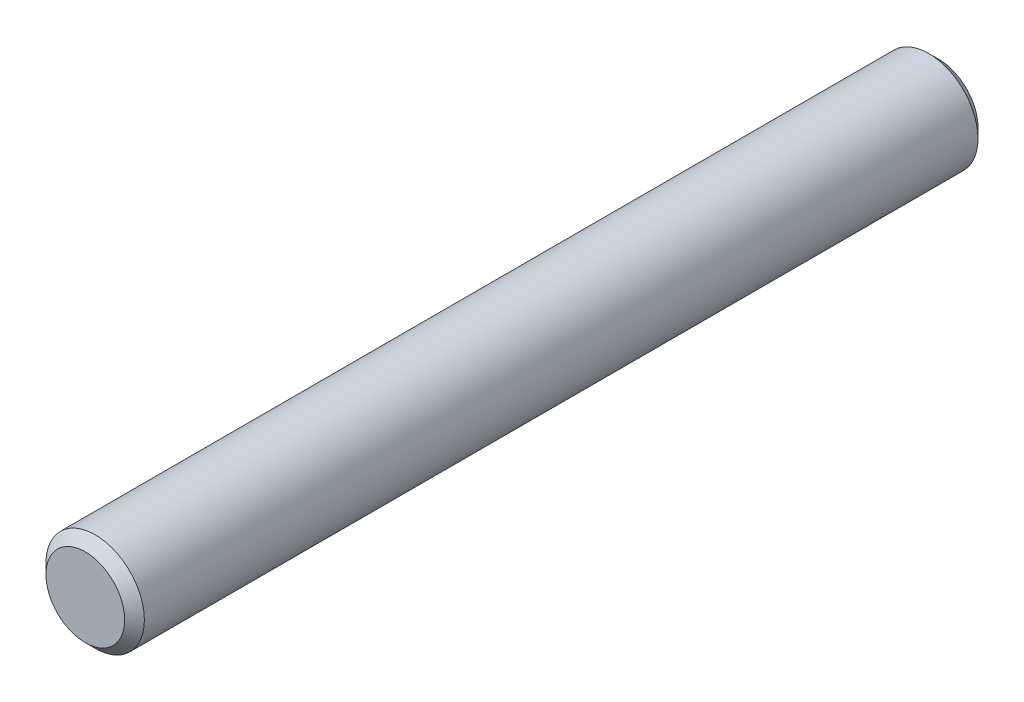
ISO-10303-21;
HEADER;
FILE_DESCRIPTION(('STEP AP214'),'2;1');
FILE_NAME('part.step','',(''),(''),'','','');
FILE_SCHEMA(('AUTOMOTIVE_DESIGN { 1 0 10303 214 1 1 1 1 }'));
ENDSEC;
DATA;
#1=APPLICATION_CONTEXT('core data for automotive mechanical design processes');
#2=APPLICATION_PROTOCOL_DEFINITION('international standard','automotive_design',2000,#1);
#3=PRODUCT_CONTEXT('',#1,'mechanical');
#4=PRODUCT('Part','Part','',(#3));
#5=PRODUCT_RELATED_PRODUCT_CATEGORY('part','',(#4));
#6=PRODUCT_DEFINITION_FORMATION('','',#4);
#7=PRODUCT_DEFINITION_CONTEXT('part definition',#1,'design');
#8=PRODUCT_DEFINITION('design','',#6,#7);
#9=PRODUCT_DEFINITION_SHAPE('','',#8);
#10=(LENGTH_UNIT() NAMED_UNIT(*) SI_UNIT(.MILLI.,.METRE.));
#11=(NAMED_UNIT(*) PLANE_ANGLE_UNIT() SI_UNIT($,.RADIAN.));
#12=(NAMED_UNIT(*) SI_UNIT($,.STERADIAN.) SOLID_ANGLE_UNIT());
#13=UNCERTAINTY_MEASURE_WITH_UNIT(LENGTH_MEASURE(1.E-05),#10,'distance_accuracy_value','');
#14=(GEOMETRIC_REPRESENTATION_CONTEXT(3) GLOBAL_UNCERTAINTY_ASSIGNED_CONTEXT((#13)) GLOBAL_UNIT_ASSIGNED_CONTEXT((#10,
#11,#12)) REPRESENTATION_CONTEXT('',''));
#15=CARTESIAN_POINT('',(0.,0.,0.));
#16=DIRECTION('',(0.,0.,1.));
#17=DIRECTION('',(1.,0.,0.));
#18=AXIS2_PLACEMENT_3D('',#15,#16,#17);
#19=CARTESIAN_POINT('',(0.,0.,13.));
#20=DIRECTION('',(0.,0.,-1.));
#21=DIRECTION('',(-1.,0.,0.));
#22=AXIS2_PLACEMENT_3D('',#19,#20,#21);
#23=CYLINDRICAL_SURFACE('',#22,1.5);
#24=CARTESIAN_POINT('',(0.,0.,-12.7));
#25=DIRECTION('',(0.,0.,1.));
#26=DIRECTION('',(1.,0.,0.));
#27=AXIS2_PLACEMENT_3D('',#24,#25,#26);
#28=CIRCLE('',#27,1.5);
#29=CARTESIAN_POINT('',(1.5,0.,-12.7));
#30=VERTEX_POINT('',#29);
#31=EDGE_CURVE('E46',#30,#30,#28,.T.);
#32=ORIENTED_EDGE('',*,*,#31,.T.);
#33=EDGE_LOOP('',(#32));
#34=FACE_BOUND('',#33,.T.);
#35=CARTESIAN_POINT('',(0.,0.,12.7));
#36=DIRECTION('',(0.,0.,1.));
#37=DIRECTION('',(1.,0.,0.));
#38=AXIS2_PLACEMENT_3D('',#35,#36,#37);
#39=CIRCLE('',#38,1.5);
#40=CARTESIAN_POINT('',(1.5,0.,12.7));
#41=VERTEX_POINT('',#40);
#42=EDGE_CURVE('E50',#41,#41,#39,.F.);
#43=ORIENTED_EDGE('',*,*,#42,.T.);
#44=EDGE_LOOP('',(#43));
#45=FACE_BOUND('',#44,.T.);
#46=ADVANCED_FACE('F34',(#34,#45),#23,.T.);
#47=CARTESIAN_POINT('',(0.,0.,13.));
#48=DIRECTION('',(0.,0.,1.));
#49=DIRECTION('',(1.,0.,0.));
#50=AXIS2_PLACEMENT_3D('',#47,#48,#49);
#51=PLANE('',#50);
#52=CARTESIAN_POINT('',(0.,0.,13.));
#53=DIRECTION('',(0.,0.,1.));
#54=DIRECTION('',(1.,0.,0.));
#55=AXIS2_PLACEMENT_3D('',#52,#53,#54);
#56=CIRCLE('',#55,1.20000000000002);
#57=CARTESIAN_POINT('',(1.20000000000002,0.,13.));
#58=VERTEX_POINT('',#57);
#59=EDGE_CURVE('E10',#58,#58,#56,.T.);
#60=ORIENTED_EDGE('',*,*,#59,.T.);
#61=EDGE_LOOP('',(#60));
#62=FACE_BOUND('',#61,.T.);
#63=ADVANCED_FACE('F66',(#62),#51,.T.);
#64=CARTESIAN_POINT('',(0.,0.,-13.));
#65=DIRECTION('',(0.,0.,1.));
#66=DIRECTION('',(1.,0.,0.));
#67=AXIS2_PLACEMENT_3D('',#64,#65,#66);
#68=PLANE('',#67);
#69=CARTESIAN_POINT('',(0.,0.,-13.));
#70=DIRECTION('',(0.,0.,1.));
#71=DIRECTION('',(1.,0.,0.));
#72=AXIS2_PLACEMENT_3D('',#69,#70,#71);
#73=CIRCLE('',#72,1.19999999999998);
#74=CARTESIAN_POINT('',(1.19999999999998,0.,-13.));
#75=VERTEX_POINT('',#74);
#76=EDGE_CURVE('E42',#75,#75,#73,.F.);
#77=ORIENTED_EDGE('',*,*,#76,.T.);
#78=EDGE_LOOP('',(#77));
#79=FACE_BOUND('',#78,.T.);
#80=ADVANCED_FACE('F63',(#79),#68,.F.);
#81=CARTESIAN_POINT('',(0.,0.,-12.7));
#82=DIRECTION('',(0.,0.,1.));
#83=DIRECTION('',(1.,0.,0.));
#84=AXIS2_PLACEMENT_3D('',#81,#82,#83);
#85=CONICAL_SURFACE('',#84,1.5,0.785398163397459);
#86=ORIENTED_EDGE('',*,*,#76,.F.);
#87=EDGE_LOOP('',(#86));
#88=FACE_BOUND('',#87,.T.);
#89=ORIENTED_EDGE('',*,*,#31,.F.);
#90=EDGE_LOOP('',(#89));
#91=FACE_BOUND('',#90,.T.);
#92=ADVANCED_FACE('F59',(#88,#91),#85,.T.);
#93=CARTESIAN_POINT('',(0.,0.,13.));
#94=DIRECTION('',(0.,0.,-1.));
#95=DIRECTION('',(-1.,0.,0.));
#96=AXIS2_PLACEMENT_3D('',#93,#94,#95);
#97=CONICAL_SURFACE('',#96,1.20000000000002,0.785398163397444);
#98=ORIENTED_EDGE('',*,*,#42,.F.);
#99=EDGE_LOOP('',(#98));
#100=FACE_BOUND('',#99,.T.);
#101=ORIENTED_EDGE('',*,*,#59,.F.);
#102=EDGE_LOOP('',(#101));
#103=FACE_BOUND('',#102,.T.);
#104=ADVANCED_FACE('F37',(#100,#103),#97,.T.);
#105=CLOSED_SHELL('',(#46,#63,#80,#92,#104));
#106=MANIFOLD_SOLID_BREP('B2',#105);
#107=ADVANCED_BREP_SHAPE_REPRESENTATION('',(#18,#106),#14);
#108=SHAPE_DEFINITION_REPRESENTATION(#9,#107);
ENDSEC;
END-ISO-10303-21;
